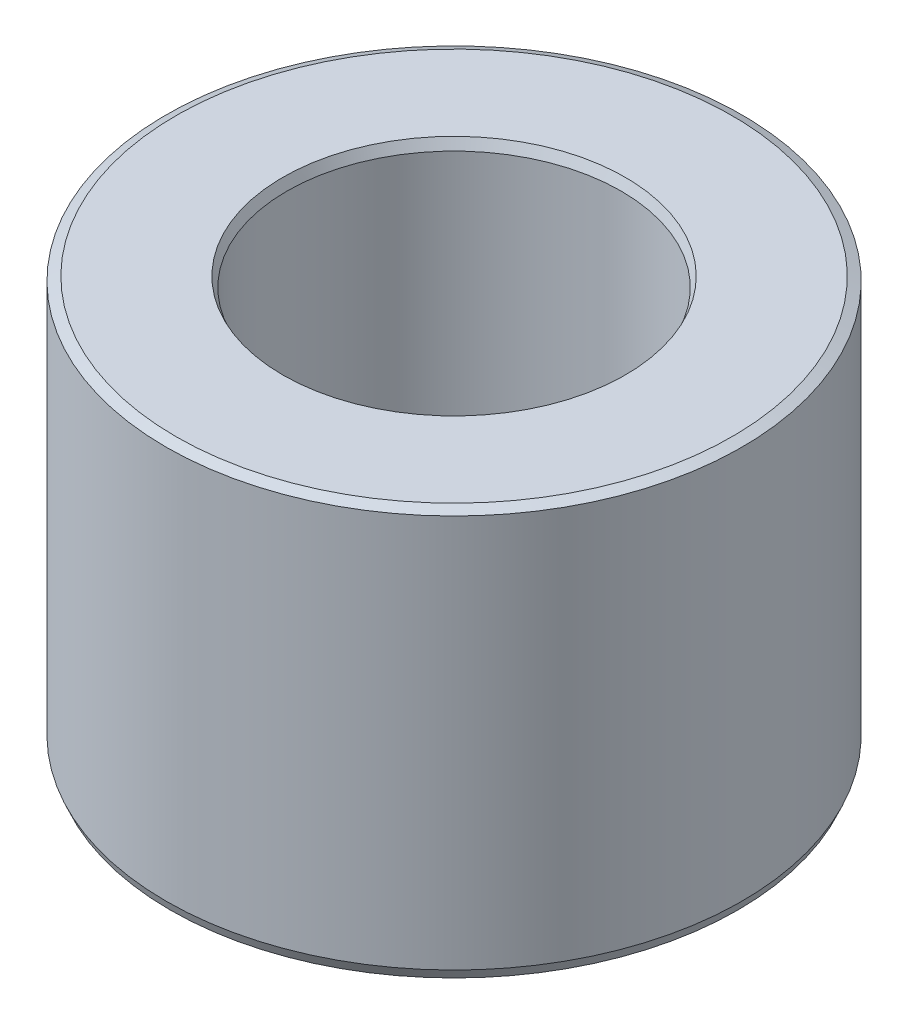
ISO-10303-21;
HEADER;
FILE_DESCRIPTION(('STEP AP214'),'2;1');
FILE_NAME('part.step','',(''),(''),'','','');
FILE_SCHEMA(('AUTOMOTIVE_DESIGN { 1 0 10303 214 1 1 1 1 }'));
ENDSEC;
DATA;
#1=APPLICATION_CONTEXT('core data for automotive mechanical design processes');
#2=APPLICATION_PROTOCOL_DEFINITION('international standard','automotive_design',2000,#1);
#3=PRODUCT_CONTEXT('',#1,'mechanical');
#4=PRODUCT('Part','Part','',(#3));
#5=PRODUCT_RELATED_PRODUCT_CATEGORY('part','',(#4));
#6=PRODUCT_DEFINITION_FORMATION('','',#4);
#7=PRODUCT_DEFINITION_CONTEXT('part definition',#1,'design');
#8=PRODUCT_DEFINITION('design','',#6,#7);
#9=PRODUCT_DEFINITION_SHAPE('','',#8);
#10=(LENGTH_UNIT() NAMED_UNIT(*) SI_UNIT(.MILLI.,.METRE.));
#11=(NAMED_UNIT(*) PLANE_ANGLE_UNIT() SI_UNIT($,.RADIAN.));
#12=(NAMED_UNIT(*) SI_UNIT($,.STERADIAN.) SOLID_ANGLE_UNIT());
#13=UNCERTAINTY_MEASURE_WITH_UNIT(LENGTH_MEASURE(1.E-05),#10,'distance_accuracy_value','');
#14=(GEOMETRIC_REPRESENTATION_CONTEXT(3) GLOBAL_UNCERTAINTY_ASSIGNED_CONTEXT((#13)) GLOBAL_UNIT_ASSIGNED_CONTEXT((#10,
#11,#12)) REPRESENTATION_CONTEXT('',''));
#15=CARTESIAN_POINT('',(0.,0.,0.));
#16=DIRECTION('',(0.,0.,1.));
#17=DIRECTION('',(1.,0.,0.));
#18=AXIS2_PLACEMENT_3D('',#15,#16,#17);
#19=CARTESIAN_POINT('',(0.,49.5079594273525,0.));
#20=DIRECTION('',(0.,-1.,0.));
#21=DIRECTION('',(0.,0.,-1.));
#22=AXIS2_PLACEMENT_3D('',#19,#20,#21);
#23=CYLINDRICAL_SURFACE('',#22,35.);
#24=CARTESIAN_POINT('',(0.,1.19450298672928,0.));
#25=DIRECTION('',(0.,1.,0.));
#26=DIRECTION('',(0.,0.,1.));
#27=AXIS2_PLACEMENT_3D('',#24,#25,#26);
#28=CIRCLE('',#27,35.);
#29=CARTESIAN_POINT('',(0.,1.19450298672928,35.));
#30=VERTEX_POINT('',#29);
#31=EDGE_CURVE('E10',#30,#30,#28,.T.);
#32=ORIENTED_EDGE('',*,*,#31,.T.);
#33=EDGE_LOOP('',(#32));
#34=FACE_BOUND('',#33,.T.);
#35=CARTESIAN_POINT('',(0.,48.9995519370578,0.));
#36=DIRECTION('',(0.,1.,0.));
#37=DIRECTION('',(0.,0.,1.));
#38=AXIS2_PLACEMENT_3D('',#35,#36,#37);
#39=CIRCLE('',#38,35.);
#40=CARTESIAN_POINT('',(0.,48.9995519370578,35.));
#41=VERTEX_POINT('',#40);
#42=EDGE_CURVE('E50',#41,#41,#39,.F.);
#43=ORIENTED_EDGE('',*,*,#42,.T.);
#44=EDGE_LOOP('',(#43));
#45=FACE_BOUND('',#44,.T.);
#46=ADVANCED_FACE('F39',(#34,#45),#23,.T.);
#47=CARTESIAN_POINT('',(0.,49.5079594273525,0.));
#48=DIRECTION('',(0.,1.,0.));
#49=DIRECTION('',(0.,0.,1.));
#50=AXIS2_PLACEMENT_3D('',#47,#48,#49);
#51=PLANE('',#50);
#52=CARTESIAN_POINT('',(0.,49.5079594273525,0.));
#53=DIRECTION('',(0.,1.,0.));
#54=DIRECTION('',(0.,0.,1.));
#55=AXIS2_PLACEMENT_3D('',#52,#53,#54);
#56=CIRCLE('',#55,20.8210668015444);
#57=CARTESIAN_POINT('',(0.,49.5079594273525,20.8210668015444));
#58=VERTEX_POINT('',#57);
#59=EDGE_CURVE('E58',#58,#58,#56,.F.);
#60=ORIENTED_EDGE('',*,*,#59,.T.);
#61=EDGE_LOOP('',(#60));
#62=FACE_BOUND('',#61,.T.);
#63=CARTESIAN_POINT('',(0.,49.5079594273525,0.));
#64=DIRECTION('',(0.,1.,0.));
#65=DIRECTION('',(0.,0.,1.));
#66=AXIS2_PLACEMENT_3D('',#63,#64,#65);
#67=CIRCLE('',#66,33.8054970132708);
#68=CARTESIAN_POINT('',(0.,49.5079594273525,33.8054970132708));
#69=VERTEX_POINT('',#68);
#70=EDGE_CURVE('E61',#69,#69,#67,.T.);
#71=ORIENTED_EDGE('',*,*,#70,.T.);
#72=EDGE_LOOP('',(#71));
#73=FACE_BOUND('',#72,.T.);
#74=ADVANCED_FACE('F88',(#62,#73),#51,.T.);
#75=CARTESIAN_POINT('',(0.,0.,0.));
#76=DIRECTION('',(0.,1.,0.));
#77=DIRECTION('',(0.,0.,1.));
#78=AXIS2_PLACEMENT_3D('',#75,#76,#77);
#79=PLANE('',#78);
#80=CARTESIAN_POINT('',(0.,0.,0.));
#81=DIRECTION('',(0.,1.,0.));
#82=DIRECTION('',(0.,0.,1.));
#83=AXIS2_PLACEMENT_3D('',#80,#81,#82);
#84=CIRCLE('',#83,21.5071622979789);
#85=CARTESIAN_POINT('',(0.,0.,21.5071622979789));
#86=VERTEX_POINT('',#85);
#87=EDGE_CURVE('E51',#86,#86,#84,.T.);
#88=ORIENTED_EDGE('',*,*,#87,.T.);
#89=EDGE_LOOP('',(#88));
#90=FACE_BOUND('',#89,.T.);
#91=CARTESIAN_POINT('',(0.,0.,0.));
#92=DIRECTION('',(0.,1.,0.));
#93=DIRECTION('',(0.,0.,1.));
#94=AXIS2_PLACEMENT_3D('',#91,#92,#93);
#95=CIRCLE('',#94,34.4915925097053);
#96=CARTESIAN_POINT('',(0.,0.,34.4915925097053));
#97=VERTEX_POINT('',#96);
#98=EDGE_CURVE('E54',#97,#97,#95,.F.);
#99=ORIENTED_EDGE('',*,*,#98,.T.);
#100=EDGE_LOOP('',(#99));
#101=FACE_BOUND('',#100,.T.);
#102=ADVANCED_FACE('F83',(#90,#101),#79,.F.);
#103=CARTESIAN_POINT('',(0.,49.5079594273525,0.));
#104=DIRECTION('',(0.,-1.,0.));
#105=DIRECTION('',(0.,0.,-1.));
#106=AXIS2_PLACEMENT_3D('',#103,#104,#105);
#107=CYLINDRICAL_SURFACE('',#106,20.3126593112497);
#108=CARTESIAN_POINT('',(0.,48.3134564406232,0.));
#109=DIRECTION('',(0.,1.,0.));
#110=DIRECTION('',(0.,0.,1.));
#111=AXIS2_PLACEMENT_3D('',#108,#109,#110);
#112=CIRCLE('',#111,20.3126593112497);
#113=CARTESIAN_POINT('',(0.,48.3134564406232,20.3126593112497));
#114=VERTEX_POINT('',#113);
#115=EDGE_CURVE('E67',#114,#114,#112,.T.);
#116=ORIENTED_EDGE('',*,*,#115,.T.);
#117=EDGE_LOOP('',(#116));
#118=FACE_BOUND('',#117,.T.);
#119=CARTESIAN_POINT('',(0.,0.508407490294738,0.));
#120=DIRECTION('',(0.,1.,0.));
#121=DIRECTION('',(0.,0.,1.));
#122=AXIS2_PLACEMENT_3D('',#119,#120,#121);
#123=CIRCLE('',#122,20.3126593112497);
#124=CARTESIAN_POINT('',(0.,0.508407490294738,20.3126593112497));
#125=VERTEX_POINT('',#124);
#126=EDGE_CURVE('E69',#125,#125,#123,.F.);
#127=ORIENTED_EDGE('',*,*,#126,.T.);
#128=EDGE_LOOP('',(#127));
#129=FACE_BOUND('',#128,.T.);
#130=ADVANCED_FACE('F71',(#118,#129),#107,.F.);
#131=CARTESIAN_POINT('',(0.,48.3134564406232,0.));
#132=DIRECTION('',(0.,1.,0.));
#133=DIRECTION('',(0.,0.,1.));
#134=AXIS2_PLACEMENT_3D('',#131,#132,#133);
#135=CONICAL_SURFACE('',#134,20.3126593112497,0.402397893598185);
#136=CARTESIAN_POINT('',(0.,49.5079594273525,20.8210668015444));
#137=CARTESIAN_POINT('',(0.,49.4955166879074,20.8157708901872));
#138=CARTESIAN_POINT('',(0.,49.4830739484623,20.8104749788299));
#139=CARTESIAN_POINT('',(0.,49.4581884695721,20.7998831561154));
#140=CARTESIAN_POINT('',(0.,49.445745730127,20.7945872447582));
#141=CARTESIAN_POINT('',(0.,49.4208602512368,20.7839954220437));
#142=CARTESIAN_POINT('',(0.,49.4084175117918,20.7786995106865));
#143=CARTESIAN_POINT('',(0.,49.3835320329016,20.768107687972));
#144=CARTESIAN_POINT('',(0.,49.3710892934565,20.7628117766148));
#145=CARTESIAN_POINT('',(0.,49.3462038145663,20.7522199539003));
#146=CARTESIAN_POINT('',(0.,49.3337610751212,20.7469240425431));
#147=CARTESIAN_POINT('',(0.,49.308875596231,20.7363322198286));
#148=CARTESIAN_POINT('',(0.,49.2964328567859,20.7310363084714));
#149=CARTESIAN_POINT('',(0.,49.2715473778957,20.7204444857569));
#150=CARTESIAN_POINT('',(0.,49.2591046384506,20.7151485743997));
#151=CARTESIAN_POINT('',(0.,49.2342191595604,20.7045567516852));
#152=CARTESIAN_POINT('',(0.,49.2217764201153,20.699260840328));
#153=CARTESIAN_POINT('',(0.,49.1968909412251,20.6886690176135));
#154=CARTESIAN_POINT('',(0.,49.18444820178,20.6833731062562));
#155=CARTESIAN_POINT('',(0.,49.1595627228898,20.6727812835418));
#156=CARTESIAN_POINT('',(0.,49.1471199834447,20.6674853721845));
#157=CARTESIAN_POINT('',(0.,49.1222345045545,20.6568935494701));
#158=CARTESIAN_POINT('',(0.,49.1097917651094,20.6515976381128));
#159=CARTESIAN_POINT('',(0.,49.0849062862192,20.6410058153983));
#160=CARTESIAN_POINT('',(0.,49.0724635467741,20.6357099040411));
#161=CARTESIAN_POINT('',(0.,49.0475780678839,20.6251180813266));
#162=CARTESIAN_POINT('',(0.,49.0351353284388,20.6198221699694));
#163=CARTESIAN_POINT('',(0.,49.0102498495486,20.6092303472549));
#164=CARTESIAN_POINT('',(0.,48.9978071101036,20.6039344358977));
#165=CARTESIAN_POINT('',(0.,48.9729216312134,20.5933426131832));
#166=CARTESIAN_POINT('',(0.,48.9604788917683,20.588046701826));
#167=CARTESIAN_POINT('',(0.,48.9355934128781,20.5774548791115));
#168=CARTESIAN_POINT('',(0.,48.923150673433,20.5721589677543));
#169=CARTESIAN_POINT('',(0.,48.8982651945428,20.5615671450398));
#170=CARTESIAN_POINT('',(0.,48.8858224550977,20.5562712336826));
#171=CARTESIAN_POINT('',(0.,48.8609369762075,20.5456794109681));
#172=CARTESIAN_POINT('',(0.,48.8484942367624,20.5403834996108));
#173=CARTESIAN_POINT('',(0.,48.8236087578722,20.5297916768964));
#174=CARTESIAN_POINT('',(0.,48.8111660184271,20.5244957655391));
#175=CARTESIAN_POINT('',(0.,48.7862805395369,20.5139039428247));
#176=CARTESIAN_POINT('',(0.,48.7738378000918,20.5086080314674));
#177=CARTESIAN_POINT('',(0.,48.7489523212016,20.4980162087529));
#178=CARTESIAN_POINT('',(0.,48.7365095817565,20.4927202973957));
#179=CARTESIAN_POINT('',(0.,48.7116241028663,20.4821284746812));
#180=CARTESIAN_POINT('',(0.,48.6991813634212,20.476832563324));
#181=CARTESIAN_POINT('',(0.,48.674295884531,20.4662407406095));
#182=CARTESIAN_POINT('',(0.,48.6618531450859,20.4609448292523));
#183=CARTESIAN_POINT('',(0.,48.6369676661957,20.4503530065378));
#184=CARTESIAN_POINT('',(0.,48.6245249267506,20.4450570951806));
#185=CARTESIAN_POINT('',(0.,48.5996394478604,20.4344652724661));
#186=CARTESIAN_POINT('',(0.,48.5871967084153,20.4291693611089));
#187=CARTESIAN_POINT('',(0.,48.5623112295251,20.4185775383944));
#188=CARTESIAN_POINT('',(0.,48.5498684900801,20.4132816270372));
#189=CARTESIAN_POINT('',(0.,48.5249830111899,20.4026898043227));
#190=CARTESIAN_POINT('',(0.,48.5125402717448,20.3973938929654));
#191=CARTESIAN_POINT('',(0.,48.4876547928546,20.386802070251));
#192=CARTESIAN_POINT('',(0.,48.4752120534095,20.3815061588937));
#193=CARTESIAN_POINT('',(0.,48.4503265745193,20.3709143361793));
#194=CARTESIAN_POINT('',(0.,48.4378838350742,20.365618424822));
#195=CARTESIAN_POINT('',(0.,48.412998356184,20.3550266021075));
#196=CARTESIAN_POINT('',(0.,48.4005556167389,20.3497306907503));
#197=CARTESIAN_POINT('',(0.,48.3756701378487,20.3391388680358));
#198=CARTESIAN_POINT('',(0.,48.3632273984036,20.3338429566786));
#199=CARTESIAN_POINT('',(0.,48.3383419195134,20.3232511339641));
#200=CARTESIAN_POINT('',(0.,48.3258991800683,20.3179552226069));
#201=CARTESIAN_POINT('',(0.,48.3134564406232,20.3126593112497));
#202=B_SPLINE_CURVE_WITH_KNOTS('',3,(#136,#137,#138,#139,#140,#141,#142,#143,#144,#145,#146,
#147,#148,#149,#150,#151,#152,#153,#154,#155,#156,#157,#158,#159,#160,#161,#162,#163,#164,#165,
#166,#167,#168,#169,#170,#171,#172,#173,#174,#175,#176,#177,#178,#179,#180,#181,#182,#183,#184,
#185,#186,#187,#188,#189,#190,#191,#192,#193,#194,#195,#196,#197,#198,#199,#200,#201),
.UNSPECIFIED.,.F.,.F.,(4,2,2,2,2,2,2,2,2,2,2,2,2,2,2,2,2,2,2,2,2,2,2,2,2,2,2,2,2,2,2,2,4),(0.,
0.0405686575821848,0.0811373151643697,0.121705972746553,0.162274630328738,0.202843287910922,
0.243411945493106,0.283980603075291,0.324549260657481,0.365117918239666,0.40568657582185,
0.446255233404034,0.486823890986219,0.527392548568403,0.567961206150588,0.608529863732771,
0.649098521314962,0.689667178897147,0.730235836479331,0.770804494061516,0.811373151643699,
0.851941809225884,0.892510466808067,0.933079124390252,0.973647781972443,1.01421643955463,
1.05478509713681,1.095353754719,1.13592241230118,1.17649106988336,1.21705972746555,
1.25762838504773,1.29819704262992),.UNSPECIFIED.);
#203=EDGE_CURVE('BSEAM77',#58,#114,#202,.T.);
#204=ORIENTED_EDGE('',*,*,#59,.F.);
#205=ORIENTED_EDGE('',*,*,#115,.F.);
#206=ORIENTED_EDGE('',*,*,#203,.T.);
#207=ORIENTED_EDGE('',*,*,#203,.F.);
#208=EDGE_LOOP('',(#204,#206,#205,#207));
#209=FACE_BOUND('',#208,.T.);
#210=ADVANCED_FACE('F77',(#209),#135,.F.);
#211=CARTESIAN_POINT('',(0.,0.,0.));
#212=DIRECTION('',(0.,-1.,0.));
#213=DIRECTION('',(0.,0.,-1.));
#214=AXIS2_PLACEMENT_3D('',#211,#212,#213);
#215=CONICAL_SURFACE('',#214,21.5071622979789,1.1683984331967);
#216=ORIENTED_EDGE('',*,*,#126,.F.);
#217=EDGE_LOOP('',(#216));
#218=FACE_BOUND('',#217,.T.);
#219=ORIENTED_EDGE('',*,*,#87,.F.);
#220=EDGE_LOOP('',(#219));
#221=FACE_BOUND('',#220,.T.);
#222=ADVANCED_FACE('F73',(#218,#221),#215,.F.);
#223=CARTESIAN_POINT('',(0.,1.19450298672928,0.));
#224=DIRECTION('',(0.,1.,0.));
#225=DIRECTION('',(0.,0.,1.));
#226=AXIS2_PLACEMENT_3D('',#223,#224,#225);
#227=CONICAL_SURFACE('',#226,35.,0.40239789359819);
#228=ORIENTED_EDGE('',*,*,#98,.F.);
#229=EDGE_LOOP('',(#228));
#230=FACE_BOUND('',#229,.T.);
#231=ORIENTED_EDGE('',*,*,#31,.F.);
#232=EDGE_LOOP('',(#231));
#233=FACE_BOUND('',#232,.T.);
#234=ADVANCED_FACE('F76',(#230,#233),#227,.T.);
#235=CARTESIAN_POINT('',(0.,49.5079594273525,0.));
#236=DIRECTION('',(0.,-1.,0.));
#237=DIRECTION('',(0.,0.,-1.));
#238=AXIS2_PLACEMENT_3D('',#235,#236,#237);
#239=CONICAL_SURFACE('',#238,33.8054970132708,1.1683984331967);
#240=ORIENTED_EDGE('',*,*,#42,.F.);
#241=EDGE_LOOP('',(#240));
#242=FACE_BOUND('',#241,.T.);
#243=ORIENTED_EDGE('',*,*,#70,.F.);
#244=EDGE_LOOP('',(#243));
#245=FACE_BOUND('',#244,.T.);
#246=ADVANCED_FACE('F45',(#242,#245),#239,.T.);
#247=CLOSED_SHELL('',(#46,#74,#102,#130,#210,#222,#234,#246));
#248=MANIFOLD_SOLID_BREP('B2',#247);
#249=ADVANCED_BREP_SHAPE_REPRESENTATION('',(#18,#248),#14);
#250=SHAPE_DEFINITION_REPRESENTATION(#9,#249);
ENDSEC;
END-ISO-10303-21;
